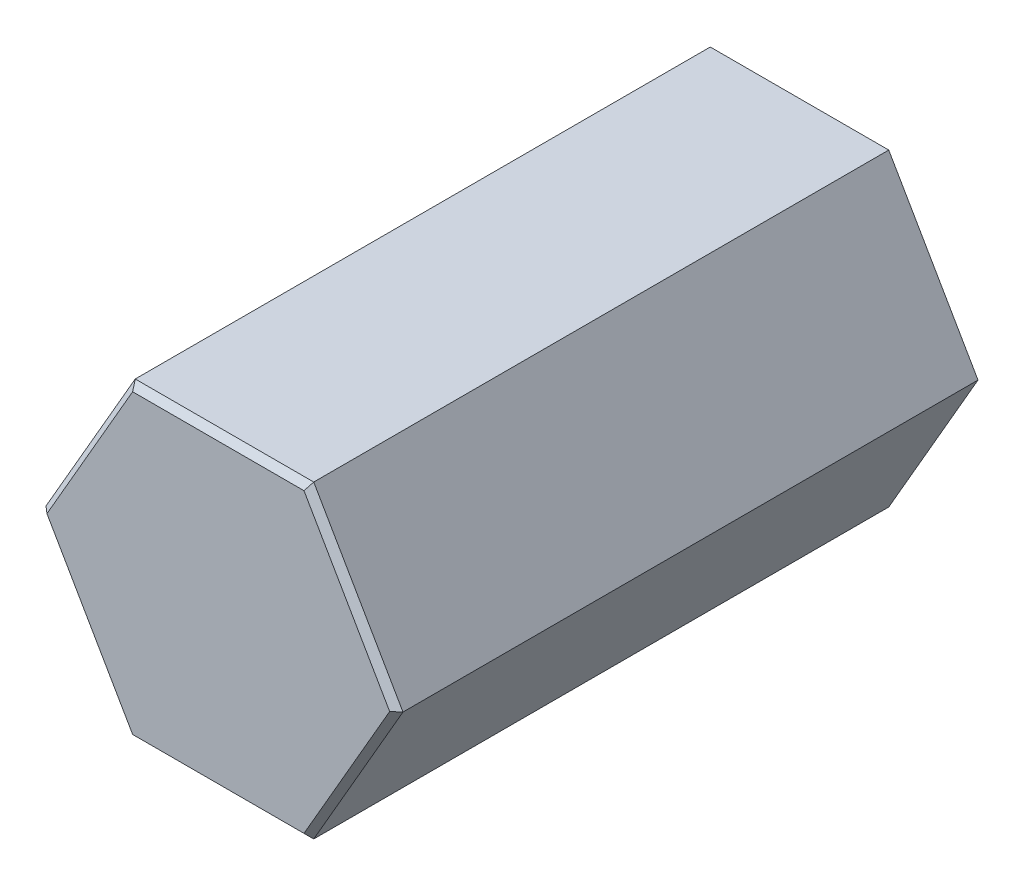
ISO-10303-21;
HEADER;
FILE_DESCRIPTION(('STEP AP214'),'2;1');
FILE_NAME('part.step','',(''),(''),'','','');
FILE_SCHEMA(('AUTOMOTIVE_DESIGN { 1 0 10303 214 1 1 1 1 }'));
ENDSEC;
DATA;
#1=APPLICATION_CONTEXT('core data for automotive mechanical design processes');
#2=APPLICATION_PROTOCOL_DEFINITION('international standard','automotive_design',2000,#1);
#3=PRODUCT_CONTEXT('',#1,'mechanical');
#4=PRODUCT('Part','Part','',(#3));
#5=PRODUCT_RELATED_PRODUCT_CATEGORY('part','',(#4));
#6=PRODUCT_DEFINITION_FORMATION('','',#4);
#7=PRODUCT_DEFINITION_CONTEXT('part definition',#1,'design');
#8=PRODUCT_DEFINITION('design','',#6,#7);
#9=PRODUCT_DEFINITION_SHAPE('','',#8);
#10=(LENGTH_UNIT() NAMED_UNIT(*) SI_UNIT(.MILLI.,.METRE.));
#11=(NAMED_UNIT(*) PLANE_ANGLE_UNIT() SI_UNIT($,.RADIAN.));
#12=(NAMED_UNIT(*) SI_UNIT($,.STERADIAN.) SOLID_ANGLE_UNIT());
#13=UNCERTAINTY_MEASURE_WITH_UNIT(LENGTH_MEASURE(1.E-05),#10,'distance_accuracy_value','');
#14=(GEOMETRIC_REPRESENTATION_CONTEXT(3) GLOBAL_UNCERTAINTY_ASSIGNED_CONTEXT((#13)) GLOBAL_UNIT_ASSIGNED_CONTEXT((#10,
#11,#12)) REPRESENTATION_CONTEXT('',''));
#15=CARTESIAN_POINT('',(0.,0.,0.));
#16=DIRECTION('',(0.,0.,1.));
#17=DIRECTION('',(1.,0.,0.));
#18=AXIS2_PLACEMENT_3D('',#15,#16,#17);
#19=CARTESIAN_POINT('',(7.11237796614698,0.127000000000015,127.));
#20=DIRECTION('',(0.612372435695803,-0.353553390593279,0.707106781186538));
#21=DIRECTION('',(-0.5,-0.866025403784439,0.));
#22=AXIS2_PLACEMENT_3D('',#19,#20,#21);
#23=PLANE('',#22);
#24=DIRECTION('',(0.377964473009223,-0.65465367070797,-0.654653670707987));
#25=VECTOR('',#24,1.);
#26=CARTESIAN_POINT('',(4.06421598065541,-7.03942857142853,126.056571428571));
#27=LINE('',#26,#25);
#28=CARTESIAN_POINT('',(3.51952724097994,-6.096,127.));
#29=VERTEX_POINT('',#28);
#30=CARTESIAN_POINT('',(3.66617420935412,-6.35,126.746));
#31=VERTEX_POINT('',#30);
#32=EDGE_CURVE('E239',#29,#31,#27,.T.);
#33=ORIENTED_EDGE('',*,*,#32,.T.);
#34=DIRECTION('',(-0.5,-0.866025403784439,0.));
#35=VECTOR('',#34,1.);
#36=CARTESIAN_POINT('',(3.66617420935412,-6.35,126.746));
#37=LINE('',#36,#35);
#38=CARTESIAN_POINT('',(7.33234841870825,0.,126.746));
#39=VERTEX_POINT('',#38);
#40=EDGE_CURVE('E163',#39,#31,#37,.T.);
#41=ORIENTED_EDGE('',*,*,#40,.F.);
#42=DIRECTION('',(-0.755928946018446,0.,0.654653670707987));
#43=VECTOR('',#42,1.);
#44=CARTESIAN_POINT('',(7.08095361578108,0.,126.963714285714));
#45=LINE('',#44,#43);
#46=CARTESIAN_POINT('',(7.03905448195989,0.,127.));
#47=VERTEX_POINT('',#46);
#48=EDGE_CURVE('E66',#39,#47,#45,.T.);
#49=ORIENTED_EDGE('',*,*,#48,.T.);
#50=DIRECTION('',(0.5,0.866025403784439,0.));
#51=VECTOR('',#50,1.);
#52=CARTESIAN_POINT('',(7.11237796614698,0.127000000000014,127.));
#53=LINE('',#52,#51);
#54=EDGE_CURVE('E208',#29,#47,#53,.T.);
#55=ORIENTED_EDGE('',*,*,#54,.F.);
#56=EDGE_LOOP('',(#33,#41,#49,#55));
#57=FACE_BOUND('',#56,.T.);
#58=ADVANCED_FACE('F58',(#57),#23,.T.);
#59=CARTESIAN_POINT('',(7.11237796614698,-0.12700000000001,127.));
#60=DIRECTION('',(0.612372435695803,0.35355339059328,0.707106781186537));
#61=DIRECTION('',(0.5,-0.866025403784438,0.));
#62=AXIS2_PLACEMENT_3D('',#59,#60,#61);
#63=PLANE('',#62);
#64=DIRECTION('',(-0.377964473009222,-0.65465367070797,0.654653670707988));
#65=VECTOR('',#64,1.);
#66=CARTESIAN_POINT('',(2.49299846236082,4.318,128.778));
#67=LINE('',#66,#65);
#68=CARTESIAN_POINT('',(3.66617420935412,6.35,126.746));
#69=VERTEX_POINT('',#68);
#70=CARTESIAN_POINT('',(3.51952724097994,6.096,127.));
#71=VERTEX_POINT('',#70);
#72=EDGE_CURVE('E234',#69,#71,#67,.T.);
#73=ORIENTED_EDGE('',*,*,#72,.T.);
#74=DIRECTION('',(-0.5,0.866025403784438,0.));
#75=VECTOR('',#74,1.);
#76=CARTESIAN_POINT('',(3.44620375679286,6.223,127.));
#77=LINE('',#76,#75);
#78=EDGE_CURVE('E212',#47,#71,#77,.T.);
#79=ORIENTED_EDGE('',*,*,#78,.F.);
#80=ORIENTED_EDGE('',*,*,#48,.F.);
#81=DIRECTION('',(0.5,-0.866025403784438,0.));
#82=VECTOR('',#81,1.);
#83=CARTESIAN_POINT('',(7.33234841870825,0.,126.746));
#84=LINE('',#83,#82);
#85=EDGE_CURVE('E185',#69,#39,#84,.T.);
#86=ORIENTED_EDGE('',*,*,#85,.F.);
#87=EDGE_LOOP('',(#73,#79,#80,#86));
#88=FACE_BOUND('',#87,.T.);
#89=ADVANCED_FACE('F248',(#88),#63,.T.);
#90=CARTESIAN_POINT('',(7.33234841870825,-6.096,127.));
#91=DIRECTION('',(0.,-0.707106781186557,0.707106781186538));
#92=DIRECTION('',(-1.,0.,0.));
#93=AXIS2_PLACEMENT_3D('',#90,#91,#92);
#94=PLANE('',#93);
#95=DIRECTION('',(-0.37796447300922,-0.654653670707971,-0.654653670707988));
#96=VECTOR('',#95,1.);
#97=CARTESIAN_POINT('',(-3.54047680789054,-6.13228571428569,126.963714285714));
#98=LINE('',#97,#96);
#99=CARTESIAN_POINT('',(-3.51952724097994,-6.096,127.));
#100=VERTEX_POINT('',#99);
#101=CARTESIAN_POINT('',(-3.66617420935412,-6.35,126.746));
#102=VERTEX_POINT('',#101);
#103=EDGE_CURVE('E231',#100,#102,#98,.T.);
#104=ORIENTED_EDGE('',*,*,#103,.T.);
#105=DIRECTION('',(-1.,0.,0.));
#106=VECTOR('',#105,1.);
#107=CARTESIAN_POINT('',(-3.66617420935412,-6.35,126.746));
#108=LINE('',#107,#106);
#109=EDGE_CURVE('E196',#31,#102,#108,.T.);
#110=ORIENTED_EDGE('',*,*,#109,.F.);
#111=ORIENTED_EDGE('',*,*,#32,.F.);
#112=DIRECTION('',(1.,0.,0.));
#113=VECTOR('',#112,1.);
#114=CARTESIAN_POINT('',(3.66617420935412,-6.096,127.));
#115=LINE('',#114,#113);
#116=EDGE_CURVE('E204',#100,#29,#115,.T.);
#117=ORIENTED_EDGE('',*,*,#116,.F.);
#118=EDGE_LOOP('',(#104,#110,#111,#117));
#119=FACE_BOUND('',#118,.T.);
#120=ADVANCED_FACE('F254',(#119),#94,.T.);
#121=CARTESIAN_POINT('',(7.33234841870825,6.096,127.));
#122=DIRECTION('',(0.,0.707106781186557,0.707106781186538));
#123=DIRECTION('',(1.,0.,0.));
#124=AXIS2_PLACEMENT_3D('',#121,#122,#123);
#125=PLANE('',#124);
#126=DIRECTION('',(0.377964473009222,-0.65465367070797,0.654653670707988));
#127=VECTOR('',#126,1.);
#128=CARTESIAN_POINT('',(-1.96925928959596,3.41085714285719,129.685142857143));
#129=LINE('',#128,#127);
#130=CARTESIAN_POINT('',(-3.66617420935412,6.35,126.746));
#131=VERTEX_POINT('',#130);
#132=CARTESIAN_POINT('',(-3.51952724097994,6.096,127.));
#133=VERTEX_POINT('',#132);
#134=EDGE_CURVE('E228',#131,#133,#129,.T.);
#135=ORIENTED_EDGE('',*,*,#134,.T.);
#136=DIRECTION('',(-1.,0.,0.));
#137=VECTOR('',#136,1.);
#138=CARTESIAN_POINT('',(-3.66617420935412,6.096,127.));
#139=LINE('',#138,#137);
#140=EDGE_CURVE('E216',#71,#133,#139,.T.);
#141=ORIENTED_EDGE('',*,*,#140,.F.);
#142=ORIENTED_EDGE('',*,*,#72,.F.);
#143=DIRECTION('',(1.,0.,0.));
#144=VECTOR('',#143,1.);
#145=CARTESIAN_POINT('',(3.66617420935412,6.35,126.746));
#146=LINE('',#145,#144);
#147=EDGE_CURVE('E176',#131,#69,#146,.T.);
#148=ORIENTED_EDGE('',*,*,#147,.F.);
#149=EDGE_LOOP('',(#135,#141,#142,#148));
#150=FACE_BOUND('',#149,.T.);
#151=ADVANCED_FACE('F282',(#150),#125,.T.);
#152=CARTESIAN_POINT('',(-3.44620375679285,-6.223,127.));
#153=DIRECTION('',(-0.612372435695804,-0.35355339059328,0.707106781186537));
#154=DIRECTION('',(-0.5,0.866025403784439,0.));
#155=AXIS2_PLACEMENT_3D('',#152,#153,#154);
#156=PLANE('',#155);
#157=DIRECTION('',(-0.755928946018445,0.,-0.654653670707988));
#158=VECTOR('',#157,1.);
#159=CARTESIAN_POINT('',(-4.98599692472164,0.,128.778));
#160=LINE('',#159,#158);
#161=CARTESIAN_POINT('',(-7.03905448195989,0.,127.));
#162=VERTEX_POINT('',#161);
#163=CARTESIAN_POINT('',(-7.33234841870824,0.,126.746));
#164=VERTEX_POINT('',#163);
#165=EDGE_CURVE('E85',#162,#164,#160,.T.);
#166=ORIENTED_EDGE('',*,*,#165,.T.);
#167=DIRECTION('',(-0.5,0.866025403784439,0.));
#168=VECTOR('',#167,1.);
#169=CARTESIAN_POINT('',(-7.33234841870824,0.,126.746));
#170=LINE('',#169,#168);
#171=EDGE_CURVE('E192',#102,#164,#170,.T.);
#172=ORIENTED_EDGE('',*,*,#171,.F.);
#173=ORIENTED_EDGE('',*,*,#103,.F.);
#174=DIRECTION('',(0.5,-0.866025403784439,0.));
#175=VECTOR('',#174,1.);
#176=CARTESIAN_POINT('',(-3.44620375679285,-6.223,127.));
#177=LINE('',#176,#175);
#178=EDGE_CURVE('E224',#162,#100,#177,.T.);
#179=ORIENTED_EDGE('',*,*,#178,.F.);
#180=EDGE_LOOP('',(#166,#172,#173,#179));
#181=FACE_BOUND('',#180,.T.);
#182=ADVANCED_FACE('F258',(#181),#156,.T.);
#183=CARTESIAN_POINT('',(-3.44620375679285,6.223,127.));
#184=DIRECTION('',(-0.612372435695804,0.353553390593279,0.707106781186537));
#185=DIRECTION('',(0.5,0.866025403784439,0.));
#186=AXIS2_PLACEMENT_3D('',#183,#184,#185);
#187=PLANE('',#186);
#188=ORIENTED_EDGE('',*,*,#134,.F.);
#189=DIRECTION('',(0.5,0.866025403784439,0.));
#190=VECTOR('',#189,1.);
#191=CARTESIAN_POINT('',(-3.66617420935412,6.35,126.746));
#192=LINE('',#191,#190);
#193=EDGE_CURVE('E171',#164,#131,#192,.T.);
#194=ORIENTED_EDGE('',*,*,#193,.F.);
#195=ORIENTED_EDGE('',*,*,#165,.F.);
#196=DIRECTION('',(-0.5,-0.866025403784439,0.));
#197=VECTOR('',#196,1.);
#198=CARTESIAN_POINT('',(-7.11237796614697,-0.127000000000013,127.));
#199=LINE('',#198,#197);
#200=EDGE_CURVE('E220',#133,#162,#199,.T.);
#201=ORIENTED_EDGE('',*,*,#200,.F.);
#202=EDGE_LOOP('',(#188,#194,#195,#201));
#203=FACE_BOUND('',#202,.T.);
#204=ADVANCED_FACE('F283',(#203),#187,.T.);
#205=CARTESIAN_POINT('',(7.33234841870825,0.,127.));
#206=DIRECTION('',(0.,0.,1.));
#207=DIRECTION('',(1.,0.,0.));
#208=AXIS2_PLACEMENT_3D('',#205,#206,#207);
#209=PLANE('',#208);
#210=ORIENTED_EDGE('',*,*,#116,.T.);
#211=ORIENTED_EDGE('',*,*,#54,.T.);
#212=ORIENTED_EDGE('',*,*,#78,.T.);
#213=ORIENTED_EDGE('',*,*,#140,.T.);
#214=ORIENTED_EDGE('',*,*,#200,.T.);
#215=ORIENTED_EDGE('',*,*,#178,.T.);
#216=EDGE_LOOP('',(#210,#211,#212,#213,#214,#215));
#217=FACE_BOUND('',#216,.T.);
#218=ADVANCED_FACE('F251',(#217),#209,.T.);
#219=CARTESIAN_POINT('',(-3.66617420935412,-6.35,127.));
#220=DIRECTION('',(0.,1.,0.));
#221=DIRECTION('',(1.,0.,0.));
#222=AXIS2_PLACEMENT_3D('',#219,#220,#221);
#223=PLANE('',#222);
#224=DIRECTION('',(0.,0.,-1.));
#225=VECTOR('',#224,1.);
#226=CARTESIAN_POINT('',(-3.66617420935412,-6.35,127.));
#227=LINE('',#226,#225);
#228=CARTESIAN_POINT('',(-3.66617420935412,-6.35,103.124));
#229=VERTEX_POINT('',#228);
#230=EDGE_CURVE('E156',#102,#229,#227,.T.);
#231=ORIENTED_EDGE('',*,*,#230,.T.);
#232=DIRECTION('',(1.,0.,0.));
#233=VECTOR('',#232,1.);
#234=CARTESIAN_POINT('',(-3.66617420935412,-6.35,103.124));
#235=LINE('',#234,#233);
#236=CARTESIAN_POINT('',(3.66617420935412,-6.35,103.124));
#237=VERTEX_POINT('',#236);
#238=EDGE_CURVE('E143',#229,#237,#235,.T.);
#239=ORIENTED_EDGE('',*,*,#238,.T.);
#240=DIRECTION('',(0.,0.,-1.));
#241=VECTOR('',#240,1.);
#242=CARTESIAN_POINT('',(3.66617420935412,-6.35,127.));
#243=LINE('',#242,#241);
#244=EDGE_CURVE('E154',#31,#237,#243,.T.);
#245=ORIENTED_EDGE('',*,*,#244,.F.);
#246=ORIENTED_EDGE('',*,*,#109,.T.);
#247=EDGE_LOOP('',(#231,#239,#245,#246));
#248=FACE_BOUND('',#247,.T.);
#249=ADVANCED_FACE('F152',(#248),#223,.F.);
#250=CARTESIAN_POINT('',(-7.33234841870824,0.,127.));
#251=DIRECTION('',(0.866025403784439,0.5,0.));
#252=DIRECTION('',(0.,0.,-1.));
#253=AXIS2_PLACEMENT_3D('',#250,#251,#252);
#254=PLANE('',#253);
#255=DIRECTION('',(0.,0.,-1.));
#256=VECTOR('',#255,1.);
#257=CARTESIAN_POINT('',(-7.33234841870824,0.,127.));
#258=LINE('',#257,#256);
#259=CARTESIAN_POINT('',(-7.33234841870824,0.,103.124));
#260=VERTEX_POINT('',#259);
#261=EDGE_CURVE('E180',#164,#260,#258,.T.);
#262=ORIENTED_EDGE('',*,*,#261,.T.);
#263=DIRECTION('',(0.5,-0.866025403784439,0.));
#264=VECTOR('',#263,1.);
#265=CARTESIAN_POINT('',(-7.33234841870824,0.,103.124));
#266=LINE('',#265,#264);
#267=EDGE_CURVE('E158',#260,#229,#266,.T.);
#268=ORIENTED_EDGE('',*,*,#267,.T.);
#269=ORIENTED_EDGE('',*,*,#230,.F.);
#270=ORIENTED_EDGE('',*,*,#171,.T.);
#271=EDGE_LOOP('',(#262,#268,#269,#270));
#272=FACE_BOUND('',#271,.T.);
#273=ADVANCED_FACE('F260',(#272),#254,.F.);
#274=CARTESIAN_POINT('',(-3.66617420935412,6.35,127.));
#275=DIRECTION('',(0.866025403784439,-0.5,0.));
#276=DIRECTION('',(0.,0.,-1.));
#277=AXIS2_PLACEMENT_3D('',#274,#275,#276);
#278=PLANE('',#277);
#279=DIRECTION('',(0.,0.,-1.));
#280=VECTOR('',#279,1.);
#281=CARTESIAN_POINT('',(-3.66617420935412,6.35,127.));
#282=LINE('',#281,#280);
#283=CARTESIAN_POINT('',(-3.66617420935412,6.35,103.124));
#284=VERTEX_POINT('',#283);
#285=EDGE_CURVE('E181',#131,#284,#282,.T.);
#286=ORIENTED_EDGE('',*,*,#285,.T.);
#287=DIRECTION('',(-0.5,-0.866025403784439,0.));
#288=VECTOR('',#287,1.);
#289=CARTESIAN_POINT('',(-3.66617420935412,6.35,103.124));
#290=LINE('',#289,#288);
#291=EDGE_CURVE('E264',#284,#260,#290,.T.);
#292=ORIENTED_EDGE('',*,*,#291,.T.);
#293=ORIENTED_EDGE('',*,*,#261,.F.);
#294=ORIENTED_EDGE('',*,*,#193,.T.);
#295=EDGE_LOOP('',(#286,#292,#293,#294));
#296=FACE_BOUND('',#295,.T.);
#297=ADVANCED_FACE('F286',(#296),#278,.F.);
#298=CARTESIAN_POINT('',(3.66617420935412,6.35,127.));
#299=DIRECTION('',(0.,-1.,0.));
#300=DIRECTION('',(0.,0.,-1.));
#301=AXIS2_PLACEMENT_3D('',#298,#299,#300);
#302=PLANE('',#301);
#303=DIRECTION('',(0.,0.,-1.));
#304=VECTOR('',#303,1.);
#305=CARTESIAN_POINT('',(3.66617420935412,6.35,127.));
#306=LINE('',#305,#304);
#307=CARTESIAN_POINT('',(3.66617420935413,6.35,103.124));
#308=VERTEX_POINT('',#307);
#309=EDGE_CURVE('E175',#69,#308,#306,.T.);
#310=ORIENTED_EDGE('',*,*,#309,.T.);
#311=DIRECTION('',(-1.,0.,0.));
#312=VECTOR('',#311,1.);
#313=CARTESIAN_POINT('',(3.66617420935412,6.35,103.124));
#314=LINE('',#313,#312);
#315=EDGE_CURVE('E267',#308,#284,#314,.T.);
#316=ORIENTED_EDGE('',*,*,#315,.T.);
#317=ORIENTED_EDGE('',*,*,#285,.F.);
#318=ORIENTED_EDGE('',*,*,#147,.T.);
#319=EDGE_LOOP('',(#310,#316,#317,#318));
#320=FACE_BOUND('',#319,.T.);
#321=ADVANCED_FACE('F278',(#320),#302,.F.);
#322=CARTESIAN_POINT('',(7.33234841870825,0.,127.));
#323=DIRECTION('',(-0.866025403784439,-0.5,0.));
#324=DIRECTION('',(-0.5,0.866025403784439,0.));
#325=AXIS2_PLACEMENT_3D('',#322,#323,#324);
#326=PLANE('',#325);
#327=DIRECTION('',(0.,0.,-1.));
#328=VECTOR('',#327,1.);
#329=CARTESIAN_POINT('',(7.33234841870825,0.,127.));
#330=LINE('',#329,#328);
#331=CARTESIAN_POINT('',(7.33234841870825,0.,103.124));
#332=VERTEX_POINT('',#331);
#333=EDGE_CURVE('E165',#39,#332,#330,.T.);
#334=ORIENTED_EDGE('',*,*,#333,.T.);
#335=DIRECTION('',(-0.5,0.866025403784439,0.));
#336=VECTOR('',#335,1.);
#337=CARTESIAN_POINT('',(7.33234841870825,0.,103.124));
#338=LINE('',#337,#336);
#339=EDGE_CURVE('E73',#332,#308,#338,.T.);
#340=ORIENTED_EDGE('',*,*,#339,.T.);
#341=ORIENTED_EDGE('',*,*,#309,.F.);
#342=ORIENTED_EDGE('',*,*,#85,.T.);
#343=EDGE_LOOP('',(#334,#340,#341,#342));
#344=FACE_BOUND('',#343,.T.);
#345=ADVANCED_FACE('F276',(#344),#326,.F.);
#346=CARTESIAN_POINT('',(3.66617420935412,-6.35,127.));
#347=DIRECTION('',(-0.866025403784439,0.5,0.));
#348=DIRECTION('',(0.,0.,1.));
#349=AXIS2_PLACEMENT_3D('',#346,#347,#348);
#350=PLANE('',#349);
#351=ORIENTED_EDGE('',*,*,#244,.T.);
#352=DIRECTION('',(0.5,0.866025403784439,0.));
#353=VECTOR('',#352,1.);
#354=CARTESIAN_POINT('',(3.66617420935412,-6.35,103.124));
#355=LINE('',#354,#353);
#356=EDGE_CURVE('E11',#237,#332,#355,.T.);
#357=ORIENTED_EDGE('',*,*,#356,.T.);
#358=ORIENTED_EDGE('',*,*,#333,.F.);
#359=ORIENTED_EDGE('',*,*,#40,.T.);
#360=EDGE_LOOP('',(#351,#357,#358,#359));
#361=FACE_BOUND('',#360,.T.);
#362=ADVANCED_FACE('F161',(#361),#350,.F.);
#363=CARTESIAN_POINT('',(0.,0.,103.124));
#364=DIRECTION('',(0.,0.,1.));
#365=DIRECTION('',(1.,0.,0.));
#366=AXIS2_PLACEMENT_3D('',#363,#364,#365);
#367=PLANE('',#366);
#368=ORIENTED_EDGE('',*,*,#267,.F.);
#369=ORIENTED_EDGE('',*,*,#291,.F.);
#370=ORIENTED_EDGE('',*,*,#315,.F.);
#371=ORIENTED_EDGE('',*,*,#339,.F.);
#372=ORIENTED_EDGE('',*,*,#356,.F.);
#373=ORIENTED_EDGE('',*,*,#238,.F.);
#374=EDGE_LOOP('',(#368,#369,#370,#371,#372,#373));
#375=FACE_BOUND('',#374,.T.);
#376=ADVANCED_FACE('F142',(#375),#367,.F.);
#377=CLOSED_SHELL('',(#58,#89,#120,#151,#182,#204,#218,#249,#273,#297,#321,#345,#362,#376));
#378=MANIFOLD_SOLID_BREP('B2',#377);
#379=ADVANCED_BREP_SHAPE_REPRESENTATION('',(#18,#378),#14);
#380=SHAPE_DEFINITION_REPRESENTATION(#9,#379);
ENDSEC;
END-ISO-10303-21;
